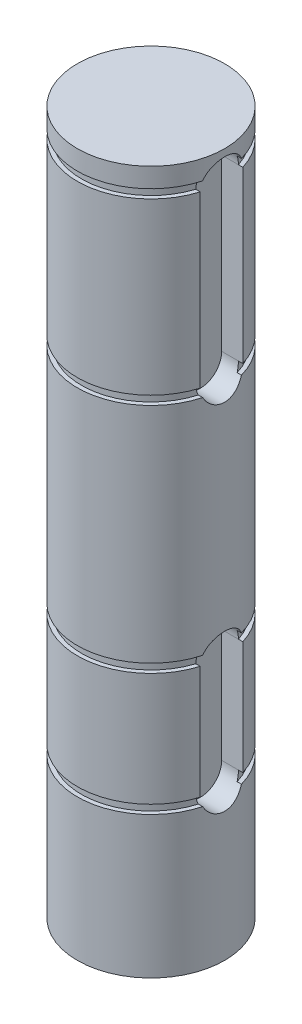
ISO-10303-21;
HEADER;
FILE_DESCRIPTION(('STEP AP214'),'2;1');
FILE_NAME('part.step','',(''),(''),'','','');
FILE_SCHEMA(('AUTOMOTIVE_DESIGN { 1 0 10303 214 1 1 1 1 }'));
ENDSEC;
DATA;
#1=APPLICATION_CONTEXT('core data for automotive mechanical design processes');
#2=APPLICATION_PROTOCOL_DEFINITION('international standard','automotive_design',2000,#1);
#3=PRODUCT_CONTEXT('',#1,'mechanical');
#4=PRODUCT('Part','Part','',(#3));
#5=PRODUCT_RELATED_PRODUCT_CATEGORY('part','',(#4));
#6=PRODUCT_DEFINITION_FORMATION('','',#4);
#7=PRODUCT_DEFINITION_CONTEXT('part definition',#1,'design');
#8=PRODUCT_DEFINITION('design','',#6,#7);
#9=PRODUCT_DEFINITION_SHAPE('','',#8);
#10=(LENGTH_UNIT() NAMED_UNIT(*) SI_UNIT(.MILLI.,.METRE.));
#11=(NAMED_UNIT(*) PLANE_ANGLE_UNIT() SI_UNIT($,.RADIAN.));
#12=(NAMED_UNIT(*) SI_UNIT($,.STERADIAN.) SOLID_ANGLE_UNIT());
#13=UNCERTAINTY_MEASURE_WITH_UNIT(LENGTH_MEASURE(1.E-05),#10,'distance_accuracy_value','');
#14=(GEOMETRIC_REPRESENTATION_CONTEXT(3) GLOBAL_UNCERTAINTY_ASSIGNED_CONTEXT((#13)) GLOBAL_UNIT_ASSIGNED_CONTEXT((#10,
#11,#12)) REPRESENTATION_CONTEXT('',''));
#15=CARTESIAN_POINT('',(0.,0.,0.));
#16=DIRECTION('',(0.,0.,1.));
#17=DIRECTION('',(1.,0.,0.));
#18=AXIS2_PLACEMENT_3D('',#15,#16,#17);
#19=CARTESIAN_POINT('',(0.,78.7908,0.));
#20=DIRECTION('',(0.,-1.,0.));
#21=DIRECTION('',(0.,0.,-1.));
#22=AXIS2_PLACEMENT_3D('',#19,#20,#21);
#23=CYLINDRICAL_SURFACE('',#22,8.255);
#24=DIRECTION('',(0.,-1.,0.));
#25=VECTOR('',#24,1.);
#26=CARTESIAN_POINT('',(7.90217636097803,78.7908,-2.3876));
#27=LINE('',#26,#25);
#28=CARTESIAN_POINT('',(7.90217636097803,56.5658,-2.3876));
#29=VERTEX_POINT('',#28);
#30=CARTESIAN_POINT('',(7.90217636097803,75.6158,-2.3876));
#31=VERTEX_POINT('',#30);
#32=EDGE_CURVE('E487',#29,#31,#27,.F.);
#33=ORIENTED_EDGE('',*,*,#32,.F.);
#34=CARTESIAN_POINT('',(0.,56.5658,0.));
#35=DIRECTION('',(0.,1.,0.));
#36=DIRECTION('',(0.,0.,1.));
#37=AXIS2_PLACEMENT_3D('',#34,#35,#36);
#38=CIRCLE('',#37,8.255);
#39=CARTESIAN_POINT('',(7.90217636097803,56.5658,2.3876));
#40=VERTEX_POINT('',#39);
#41=EDGE_CURVE('E339',#29,#40,#38,.T.);
#42=ORIENTED_EDGE('',*,*,#41,.T.);
#43=DIRECTION('',(0.,-1.,0.));
#44=VECTOR('',#43,1.);
#45=CARTESIAN_POINT('',(7.90217636097803,78.7908,2.3876));
#46=LINE('',#45,#44);
#47=CARTESIAN_POINT('',(7.90217636097803,75.6158,2.3876));
#48=VERTEX_POINT('',#47);
#49=EDGE_CURVE('E485',#40,#48,#46,.F.);
#50=ORIENTED_EDGE('',*,*,#49,.T.);
#51=CARTESIAN_POINT('',(0.,75.6158,0.));
#52=DIRECTION('',(0.,-1.,0.));
#53=DIRECTION('',(0.,0.,-1.));
#54=AXIS2_PLACEMENT_3D('',#51,#52,#53);
#55=CIRCLE('',#54,8.255);
#56=EDGE_CURVE('E348',#48,#31,#55,.T.);
#57=ORIENTED_EDGE('',*,*,#56,.T.);
#58=EDGE_LOOP('',(#33,#42,#50,#57));
#59=FACE_BOUND('',#58,.T.);
#60=ADVANCED_FACE('F33',(#59),#23,.T.);
#61=CARTESIAN_POINT('',(0.,75.6158,21.1239367260535));
#62=DIRECTION('',(0.,-1.,0.));
#63=DIRECTION('',(0.,0.,-1.));
#64=AXIS2_PLACEMENT_3D('',#61,#62,#63);
#65=PLANE('',#64);
#66=DIRECTION('',(1.,0.,0.));
#67=VECTOR('',#66,1.);
#68=CARTESIAN_POINT('',(5.5372,75.6158,-2.3876));
#69=LINE('',#68,#67);
#70=CARTESIAN_POINT('',(7.40993577907393,75.6158,-2.3876));
#71=VERTEX_POINT('',#70);
#72=EDGE_CURVE('E469',#71,#31,#69,.T.);
#73=ORIENTED_EDGE('',*,*,#72,.T.);
#74=ORIENTED_EDGE('',*,*,#56,.F.);
#75=DIRECTION('',(1.,0.,0.));
#76=VECTOR('',#75,1.);
#77=CARTESIAN_POINT('',(5.5372,75.6158,2.3876));
#78=LINE('',#77,#76);
#79=CARTESIAN_POINT('',(7.40993577907393,75.6158,2.3876));
#80=VERTEX_POINT('',#79);
#81=EDGE_CURVE('E465',#80,#48,#78,.T.);
#82=ORIENTED_EDGE('',*,*,#81,.F.);
#83=CARTESIAN_POINT('',(0.,75.6158,0.));
#84=DIRECTION('',(0.,1.,0.));
#85=DIRECTION('',(0.,0.,1.));
#86=AXIS2_PLACEMENT_3D('',#83,#84,#85);
#87=CIRCLE('',#86,7.7851);
#88=EDGE_CURVE('E349',#71,#80,#87,.T.);
#89=ORIENTED_EDGE('',*,*,#88,.F.);
#90=EDGE_LOOP('',(#73,#74,#82,#89));
#91=FACE_BOUND('',#90,.T.);
#92=ADVANCED_FACE('F287',(#91),#65,.F.);
#93=CARTESIAN_POINT('',(0.,55.5752,0.));
#94=DIRECTION('',(0.,-1.,0.));
#95=DIRECTION('',(0.,0.,-1.));
#96=AXIS2_PLACEMENT_3D('',#93,#94,#95);
#97=CIRCLE('',#96,8.255);
#98=CARTESIAN_POINT('',(7.96402408333877,55.5752,2.17240544098012));
#99=VERTEX_POINT('',#98);
#100=CARTESIAN_POINT('',(7.96402408333877,55.5752,-2.17240544098012));
#101=VERTEX_POINT('',#100);
#102=EDGE_CURVE('E342',#99,#101,#97,.T.);
#103=ORIENTED_EDGE('',*,*,#102,.T.);
#104=CARTESIAN_POINT('',(7.96402408333877,55.5752,-2.17240544098012));
#105=CARTESIAN_POINT('',(7.97169577027827,55.5135028583923,-2.14427075589016));
#106=CARTESIAN_POINT('',(7.97991829908887,55.4530949946041,-2.11355004383941));
#107=CARTESIAN_POINT('',(7.99720969642223,55.3352051903105,-2.0471567488907));
#108=CARTESIAN_POINT('',(8.00627841649396,55.2777227393116,-2.01148503403551));
#109=CARTESIAN_POINT('',(8.03435165880443,55.1102939537849,-1.89745365359604));
#110=CARTESIAN_POINT('',(8.05424396663146,55.0052083401573,-1.81200544231608));
#111=CARTESIAN_POINT('',(8.09410976756713,54.8110088215255,-1.62467488545157));
#112=CARTESIAN_POINT('',(8.11408326047165,54.7218948763856,-1.52279258116598));
#113=CARTESIAN_POINT('',(8.15191204625405,54.5619735436004,-1.30519198993988));
#114=CARTESIAN_POINT('',(8.16976772503073,54.491162818041,-1.18947623141052));
#115=CARTESIAN_POINT('',(8.20137618388929,54.3699819461733,-0.947284663026625));
#116=CARTESIAN_POINT('',(8.215129708747,54.319608088804,-0.820810811747385));
#117=CARTESIAN_POINT('',(8.23696946481187,54.2409961498277,-0.560685765782547));
#118=CARTESIAN_POINT('',(8.24505663417444,54.2127544038054,-0.427035763170005));
#119=CARTESIAN_POINT('',(8.25445652866956,54.1800303366697,-0.161340788264656));
#120=CARTESIAN_POINT('',(8.25599432683837,54.1747584901117,-0.0294007242491811));
#121=CARTESIAN_POINT('',(8.25274463000109,54.1860033251679,0.233454776654716));
#122=CARTESIAN_POINT('',(8.24795795965833,54.2025171660911,0.364370344890828));
#123=CARTESIAN_POINT('',(8.23272800264975,54.2562415744426,0.619039509085313));
#124=CARTESIAN_POINT('',(8.22238823644558,54.2930737006308,0.742879667038545));
#125=CARTESIAN_POINT('',(8.19719545606846,54.3859805474894,0.982626452653792));
#126=CARTESIAN_POINT('',(8.18234173390735,54.4420582869026,1.09853183229459));
#127=CARTESIAN_POINT('',(8.14922087599029,54.5734301786252,1.32224716698361));
#128=CARTESIAN_POINT('',(8.13087884582117,54.6491625869387,1.42978827893818));
#129=CARTESIAN_POINT('',(8.09294262671588,54.8170836561444,1.63088433939873));
#130=CARTESIAN_POINT('',(8.07334853961365,54.9092709797948,1.72444042329187));
#131=CARTESIAN_POINT('',(8.0376978400469,55.0936786428651,1.88311126462589));
#132=CARTESIAN_POINT('',(8.02153390801541,55.1840366361781,1.95037813914544));
#133=CARTESIAN_POINT('',(7.99107010580958,55.3734766789996,2.07163786545587));
#134=CARTESIAN_POINT('',(7.97676935405323,55.4725545651493,2.12563700579866));
#135=CARTESIAN_POINT('',(7.96402408333877,55.5752,2.17240544098012));
#136=B_SPLINE_CURVE_WITH_KNOTS('',3,(#104,#105,#106,#107,#108,#109,#110,#111,#112,#113,#114,
#115,#116,#117,#118,#119,#120,#121,#122,#123,#124,#125,#126,#127,#128,#129,#130,#131,#132,#133,
#134,#135),.UNSPECIFIED.,.F.,.F.,(4,2,2,2,2,2,2,2,2,2,2,2,2,2,2,4),(0.,0.204590558318854,
0.409145291665196,0.817736949036483,1.22632757963125,1.63484364387965,2.0432854938585,
2.4516597037935,2.84588058093287,3.24005005969466,3.62711431171269,4.01423930390274,
4.41087506402956,4.80747860541408,5.14778271292316,5.48792521286564),.UNSPECIFIED.);
#137=EDGE_CURVE('E408',#101,#99,#136,.T.);
#138=ORIENTED_EDGE('',*,*,#137,.T.);
#139=EDGE_LOOP('',(#103,#138));
#140=FACE_BOUND('',#139,.T.);
#141=CARTESIAN_POINT('',(0.,30.5562,0.));
#142=DIRECTION('',(0.,1.,0.));
#143=DIRECTION('',(0.,0.,1.));
#144=AXIS2_PLACEMENT_3D('',#141,#142,#143);
#145=CIRCLE('',#144,8.255);
#146=CARTESIAN_POINT('',(7.96402408333878,30.5562,-2.17240544098011));
#147=VERTEX_POINT('',#146);
#148=CARTESIAN_POINT('',(7.96402408333878,30.5562,2.1724054409801));
#149=VERTEX_POINT('',#148);
#150=EDGE_CURVE('E331',#147,#149,#145,.T.);
#151=ORIENTED_EDGE('',*,*,#150,.T.);
#152=CARTESIAN_POINT('',(7.96402408333878,30.5562,2.1724054409801));
#153=CARTESIAN_POINT('',(7.97169577027827,30.6178971416077,2.14427075589015));
#154=CARTESIAN_POINT('',(7.97991829908888,30.6783050053959,2.11355004383939));
#155=CARTESIAN_POINT('',(7.99720969642224,30.7961948096895,2.04715674889068));
#156=CARTESIAN_POINT('',(8.00627841649396,30.8536772606885,2.01148503403549));
#157=CARTESIAN_POINT('',(8.03435165880444,31.0211060462152,1.89745365359602));
#158=CARTESIAN_POINT('',(8.05424396663146,31.1261916598427,1.81200544231605));
#159=CARTESIAN_POINT('',(8.09410976756714,31.3203911784745,1.62467488545154));
#160=CARTESIAN_POINT('',(8.11408326047166,31.4095051236145,1.52279258116594));
#161=CARTESIAN_POINT('',(8.15191204625405,31.5694264563996,1.30519198993985));
#162=CARTESIAN_POINT('',(8.16976772503074,31.640237181959,1.18947623141048));
#163=CARTESIAN_POINT('',(8.2013761838893,31.7614180538268,0.947284663026578));
#164=CARTESIAN_POINT('',(8.21512970874701,31.811791911196,0.820810811747337));
#165=CARTESIAN_POINT('',(8.23696946481188,31.8904038501723,0.560685765782498));
#166=CARTESIAN_POINT('',(8.24505663417445,31.9186455961946,0.427035763169954));
#167=CARTESIAN_POINT('',(8.25445652866956,31.9513696633304,0.161340788264606));
#168=CARTESIAN_POINT('',(8.25599432683836,31.9566415098883,0.0294007242491316));
#169=CARTESIAN_POINT('',(8.25274463000109,31.9453966748321,-0.233454776654763));
#170=CARTESIAN_POINT('',(8.24795795965833,31.9288828339089,-0.364370344890874));
#171=CARTESIAN_POINT('',(8.23272800264974,31.8751584255574,-0.619039509085359));
#172=CARTESIAN_POINT('',(8.22238823644557,31.8383262993692,-0.74287966703859));
#173=CARTESIAN_POINT('',(8.19719545606845,31.7454194525105,-0.982626452653835));
#174=CARTESIAN_POINT('',(8.18234173390735,31.6893417130973,-1.09853183229463));
#175=CARTESIAN_POINT('',(8.14922087599029,31.5579698213747,-1.32224716698365));
#176=CARTESIAN_POINT('',(8.13087884582117,31.4822374130613,-1.42978827893822));
#177=CARTESIAN_POINT('',(8.09294262671587,31.3143163438555,-1.63088433939877));
#178=CARTESIAN_POINT('',(8.07334853961364,31.2221290202051,-1.7244404232919));
#179=CARTESIAN_POINT('',(8.0376978400469,31.0377213571349,-1.88311126462591));
#180=CARTESIAN_POINT('',(8.02153390801541,30.9473633638219,-1.95037813914545));
#181=CARTESIAN_POINT('',(7.99107010580959,30.7579233210004,-2.07163786545587));
#182=CARTESIAN_POINT('',(7.97676935405324,30.6588454348507,-2.12563700579865));
#183=CARTESIAN_POINT('',(7.96402408333878,30.5562,-2.1724054409801));
#184=B_SPLINE_CURVE_WITH_KNOTS('',3,(#152,#153,#154,#155,#156,#157,#158,#159,#160,#161,#162,
#163,#164,#165,#166,#167,#168,#169,#170,#171,#172,#173,#174,#175,#176,#177,#178,#179,#180,#181,
#182,#183),.UNSPECIFIED.,.F.,.F.,(4,2,2,2,2,2,2,2,2,2,2,2,2,2,2,4),(0.,0.204590558318864,
0.409145291665203,0.817736949036493,1.22632757963126,1.63484364387966,2.04328549385852,
2.45165970379352,2.84588058093289,3.24005005969467,3.6271143117127,4.01423930390275,
4.41087506402957,4.8074786054141,5.14778271292313,5.48792521286557),.UNSPECIFIED.);
#185=EDGE_CURVE('E214',#149,#147,#184,.T.);
#186=ORIENTED_EDGE('',*,*,#185,.T.);
#187=EDGE_LOOP('',(#151,#186));
#188=FACE_BOUND('',#187,.T.);
#189=ADVANCED_FACE('F289',(#140,#188),#23,.T.);
#190=CARTESIAN_POINT('',(0.,29.5656,0.));
#191=DIRECTION('',(0.,-1.,0.));
#192=DIRECTION('',(0.,0.,-1.));
#193=AXIS2_PLACEMENT_3D('',#190,#191,#192);
#194=CIRCLE('',#193,8.255);
#195=CARTESIAN_POINT('',(7.90217636097803,29.5656,2.3876));
#196=VERTEX_POINT('',#195);
#197=CARTESIAN_POINT('',(7.90217636097803,29.5656,-2.3876));
#198=VERTEX_POINT('',#197);
#199=EDGE_CURVE('E334',#196,#198,#194,.T.);
#200=ORIENTED_EDGE('',*,*,#199,.T.);
#201=DIRECTION('',(0.,-1.,0.));
#202=VECTOR('',#201,1.);
#203=CARTESIAN_POINT('',(7.90217636097803,78.7908,-2.38759999999999));
#204=LINE('',#203,#202);
#205=CARTESIAN_POINT('',(7.90217636097803,16.8656,-2.3876));
#206=VERTEX_POINT('',#205);
#207=EDGE_CURVE('E693',#198,#206,#204,.T.);
#208=ORIENTED_EDGE('',*,*,#207,.T.);
#209=CARTESIAN_POINT('',(0.,16.8656,0.));
#210=DIRECTION('',(0.,1.,0.));
#211=DIRECTION('',(0.,0.,1.));
#212=AXIS2_PLACEMENT_3D('',#209,#210,#211);
#213=CIRCLE('',#212,8.255);
#214=CARTESIAN_POINT('',(7.90217636097803,16.8656,2.3876));
#215=VERTEX_POINT('',#214);
#216=EDGE_CURVE('E326',#206,#215,#213,.T.);
#217=ORIENTED_EDGE('',*,*,#216,.T.);
#218=DIRECTION('',(0.,-1.,0.));
#219=VECTOR('',#218,1.);
#220=CARTESIAN_POINT('',(7.90217636097803,78.7908,2.38760000000001));
#221=LINE('',#220,#219);
#222=EDGE_CURVE('E698',#215,#196,#221,.F.);
#223=ORIENTED_EDGE('',*,*,#222,.T.);
#224=EDGE_LOOP('',(#200,#208,#217,#223));
#225=FACE_BOUND('',#224,.T.);
#226=ADVANCED_FACE('F283',(#225),#23,.T.);
#227=CARTESIAN_POINT('',(0.,15.875,0.));
#228=DIRECTION('',(0.,-1.,0.));
#229=DIRECTION('',(0.,0.,-1.));
#230=AXIS2_PLACEMENT_3D('',#227,#228,#229);
#231=CIRCLE('',#230,8.255);
#232=CARTESIAN_POINT('',(7.96402408333877,15.875,2.17240544098013));
#233=VERTEX_POINT('',#232);
#234=CARTESIAN_POINT('',(7.96402408333877,15.875,-2.17240544098011));
#235=VERTEX_POINT('',#234);
#236=EDGE_CURVE('E320',#233,#235,#231,.T.);
#237=ORIENTED_EDGE('',*,*,#236,.T.);
#238=CARTESIAN_POINT('',(7.96402408333877,15.875,-2.17240544098013));
#239=CARTESIAN_POINT('',(7.97169577027826,15.8133028583923,-2.14427075589017));
#240=CARTESIAN_POINT('',(7.97991829908887,15.7528949946041,-2.11355004383941));
#241=CARTESIAN_POINT('',(7.99720969642223,15.6350051903105,-2.0471567488907));
#242=CARTESIAN_POINT('',(8.00627841649396,15.5775227393116,-2.01148503403552));
#243=CARTESIAN_POINT('',(8.03435165880443,15.4100939537849,-1.89745365359605));
#244=CARTESIAN_POINT('',(8.05424396663146,15.3050083401573,-1.81200544231608));
#245=CARTESIAN_POINT('',(8.09410976756713,15.1108088215255,-1.62467488545158));
#246=CARTESIAN_POINT('',(8.11408326047165,15.0216948763856,-1.52279258116599));
#247=CARTESIAN_POINT('',(8.15191204625405,14.8617735436004,-1.30519198993989));
#248=CARTESIAN_POINT('',(8.16976772503073,14.7909628180411,-1.18947623141053));
#249=CARTESIAN_POINT('',(8.20137618388929,14.6697819461733,-0.947284663026633));
#250=CARTESIAN_POINT('',(8.215129708747,14.619408088804,-0.820810811747394));
#251=CARTESIAN_POINT('',(8.23696946481187,14.5407961498277,-0.560685765782558));
#252=CARTESIAN_POINT('',(8.24505663417444,14.5125544038054,-0.427035763170016));
#253=CARTESIAN_POINT('',(8.25445652866956,14.4798303366697,-0.161340788264669));
#254=CARTESIAN_POINT('',(8.25599432683837,14.4745584901117,-0.0294007242491934));
#255=CARTESIAN_POINT('',(8.25274463000109,14.4858033251679,0.233454776654704));
#256=CARTESIAN_POINT('',(8.24795795965833,14.5023171660911,0.364370344890817));
#257=CARTESIAN_POINT('',(8.23272800264975,14.5560415744426,0.619039509085303));
#258=CARTESIAN_POINT('',(8.22238823644558,14.5928737006308,0.742879667038535));
#259=CARTESIAN_POINT('',(8.19719545606846,14.6857805474894,0.982626452653782));
#260=CARTESIAN_POINT('',(8.18234173390735,14.7418582869026,1.09853183229458));
#261=CARTESIAN_POINT('',(8.1492208759903,14.8732301786252,1.3222471669836));
#262=CARTESIAN_POINT('',(8.13087884582118,14.9489625869387,1.42978827893817));
#263=CARTESIAN_POINT('',(8.09294262671588,15.1168836561444,1.63088433939872));
#264=CARTESIAN_POINT('',(8.07334853961365,15.2090709797948,1.72444042329186));
#265=CARTESIAN_POINT('',(8.0376978400469,15.3934786428651,1.88311126462589));
#266=CARTESIAN_POINT('',(8.02153390801541,15.4838366361781,1.95037813914544));
#267=CARTESIAN_POINT('',(7.99107010580958,15.6732766789996,2.07163786545588));
#268=CARTESIAN_POINT('',(7.97676935405323,15.7723545651493,2.12563700579867));
#269=CARTESIAN_POINT('',(7.96402408333877,15.875,2.17240544098013));
#270=B_SPLINE_CURVE_WITH_KNOTS('',3,(#238,#239,#240,#241,#242,#243,#244,#245,#246,#247,#248,
#249,#250,#251,#252,#253,#254,#255,#256,#257,#258,#259,#260,#261,#262,#263,#264,#265,#266,#267,
#268,#269),.UNSPECIFIED.,.F.,.F.,(4,2,2,2,2,2,2,2,2,2,2,2,2,2,2,4),(0.,0.204590558318864,
0.409145291665199,0.817736949036489,1.22632757963126,1.63484364387966,2.04328549385851,
2.45165970379351,2.84588058093288,3.24005005969467,3.62711431171269,4.01423930390274,
4.41087506402956,4.80747860541409,5.14778271292318,5.48792521286568),.UNSPECIFIED.);
#271=EDGE_CURVE('E447',#235,#233,#270,.T.);
#272=ORIENTED_EDGE('',*,*,#271,.T.);
#273=EDGE_LOOP('',(#237,#272));
#274=FACE_BOUND('',#273,.T.);
#275=CARTESIAN_POINT('',(0.,0.,0.));
#276=DIRECTION('',(0.,1.,0.));
#277=DIRECTION('',(0.,0.,1.));
#278=AXIS2_PLACEMENT_3D('',#275,#276,#277);
#279=CIRCLE('',#278,8.255);
#280=CARTESIAN_POINT('',(0.,0.,8.255));
#281=VERTEX_POINT('',#280);
#282=EDGE_CURVE('E315',#281,#281,#279,.T.);
#283=ORIENTED_EDGE('',*,*,#282,.T.);
#284=EDGE_LOOP('',(#283));
#285=FACE_BOUND('',#284,.T.);
#286=ADVANCED_FACE('F278',(#274,#285),#23,.T.);
#287=CARTESIAN_POINT('',(0.,0.,0.));
#288=DIRECTION('',(0.,1.,0.));
#289=DIRECTION('',(0.,0.,1.));
#290=AXIS2_PLACEMENT_3D('',#287,#288,#289);
#291=PLANE('',#290);
#292=ORIENTED_EDGE('',*,*,#282,.F.);
#293=EDGE_LOOP('',(#292));
#294=FACE_BOUND('',#293,.T.);
#295=ADVANCED_FACE('F271',(#294),#291,.F.);
#296=CARTESIAN_POINT('',(0.,15.875,35.9296438771156));
#297=DIRECTION('',(0.,-1.,0.));
#298=DIRECTION('',(0.,0.,-1.));
#299=AXIS2_PLACEMENT_3D('',#296,#297,#298);
#300=PLANE('',#299);
#301=CARTESIAN_POINT('',(0.,15.875,0.));
#302=DIRECTION('',(0.,1.,0.));
#303=DIRECTION('',(0.,0.,1.));
#304=AXIS2_PLACEMENT_3D('',#301,#302,#303);
#305=CIRCLE('',#304,7.7851);
#306=CARTESIAN_POINT('',(7.47585691476235,15.875,-2.17240544098011));
#307=VERTEX_POINT('',#306);
#308=CARTESIAN_POINT('',(7.47585691476235,15.875,2.17240544098011));
#309=VERTEX_POINT('',#308);
#310=EDGE_CURVE('E323',#307,#309,#305,.T.);
#311=ORIENTED_EDGE('',*,*,#310,.F.);
#312=DIRECTION('',(1.,0.,0.));
#313=VECTOR('',#312,1.);
#314=CARTESIAN_POINT('',(5.5372,15.875,-2.17240544098011));
#315=LINE('',#314,#313);
#316=EDGE_CURVE('E442',#307,#235,#315,.T.);
#317=ORIENTED_EDGE('',*,*,#316,.T.);
#318=ORIENTED_EDGE('',*,*,#236,.F.);
#319=DIRECTION('',(1.,0.,0.));
#320=VECTOR('',#319,1.);
#321=CARTESIAN_POINT('',(5.5372,15.875,2.17240544098011));
#322=LINE('',#321,#320);
#323=EDGE_CURVE('E443',#233,#309,#322,.F.);
#324=ORIENTED_EDGE('',*,*,#323,.T.);
#325=EDGE_LOOP('',(#311,#317,#318,#324));
#326=FACE_BOUND('',#325,.T.);
#327=ADVANCED_FACE('F262',(#326),#300,.F.);
#328=CARTESIAN_POINT('',(0.,16.8656,35.9296438771156));
#329=DIRECTION('',(0.,1.,0.));
#330=DIRECTION('',(0.,0.,1.));
#331=AXIS2_PLACEMENT_3D('',#328,#329,#330);
#332=PLANE('',#331);
#333=ORIENTED_EDGE('',*,*,#216,.F.);
#334=DIRECTION('',(1.,0.,0.));
#335=VECTOR('',#334,1.);
#336=CARTESIAN_POINT('',(5.5372,16.8656,-2.3876));
#337=LINE('',#336,#335);
#338=CARTESIAN_POINT('',(7.40993577907393,16.8656,-2.3876));
#339=VERTEX_POINT('',#338);
#340=EDGE_CURVE('E210',#339,#206,#337,.T.);
#341=ORIENTED_EDGE('',*,*,#340,.F.);
#342=CARTESIAN_POINT('',(0.,16.8656,0.));
#343=DIRECTION('',(0.,1.,0.));
#344=DIRECTION('',(0.,0.,1.));
#345=AXIS2_PLACEMENT_3D('',#342,#343,#344);
#346=CIRCLE('',#345,7.7851);
#347=CARTESIAN_POINT('',(7.40993577907393,16.8656,2.3876));
#348=VERTEX_POINT('',#347);
#349=EDGE_CURVE('E338',#339,#348,#346,.T.);
#350=ORIENTED_EDGE('',*,*,#349,.T.);
#351=DIRECTION('',(1.,0.,0.));
#352=VECTOR('',#351,1.);
#353=CARTESIAN_POINT('',(5.5372,16.8656,2.3876));
#354=LINE('',#353,#352);
#355=EDGE_CURVE('E184',#348,#215,#354,.T.);
#356=ORIENTED_EDGE('',*,*,#355,.T.);
#357=EDGE_LOOP('',(#333,#341,#350,#356));
#358=FACE_BOUND('',#357,.T.);
#359=ADVANCED_FACE('F260',(#358),#332,.F.);
#360=CARTESIAN_POINT('',(0.,29.9273187776748,0.));
#361=DIRECTION('',(0.,1.,0.));
#362=DIRECTION('',(0.,0.,1.));
#363=AXIS2_PLACEMENT_3D('',#360,#361,#362);
#364=CYLINDRICAL_SURFACE('',#363,7.7851);
#365=ORIENTED_EDGE('',*,*,#310,.T.);
#366=CARTESIAN_POINT('',(7.47585691476235,15.875,2.17240544098011));
#367=CARTESIAN_POINT('',(7.46800770533335,15.9341869066255,2.19940220788417));
#368=CARTESIAN_POINT('',(7.46070607178622,15.9945486977164,2.22399697790815));
#369=CARTESIAN_POINT('',(7.44738110721465,16.1172470052637,2.26822571826626));
#370=CARTESIAN_POINT('',(7.44135866431199,16.1795848593837,2.28785624379459));
#371=CARTESIAN_POINT('',(7.43088439285811,16.304610073417,2.32164641591105));
#372=CARTESIAN_POINT('',(7.42640557289467,16.3672696397758,2.33590054193313));
#373=CARTESIAN_POINT('',(7.41900078301951,16.493587396284,2.35931384822128));
#374=CARTESIAN_POINT('',(7.41607376574984,16.5572448829555,2.36847646510037));
#375=CARTESIAN_POINT('',(7.41263170277545,16.6616451752925,2.379220810497));
#376=CARTESIAN_POINT('',(7.41162565083335,16.702219203553,2.38235078269739));
#377=CARTESIAN_POINT('',(7.41027512040859,16.7837267119815,2.38654694530532));
#378=CARTESIAN_POINT('',(7.40993461014244,16.8246608951542,2.38760075713839));
#379=CARTESIAN_POINT('',(7.40993577907393,16.8656,2.3876));
#380=B_SPLINE_CURVE_WITH_KNOTS('',3,(#366,#367,#368,#369,#370,#371,#372,#373,#374,#375,#376,
#377,#378,#379),.UNSPECIFIED.,.F.,.F.,(4,2,2,2,2,2,4),(0.,0.196528648046228,0.393193300010768,
0.586220206334327,0.779116666648224,0.901183670504069,1.02397629117905),.UNSPECIFIED.);
#381=EDGE_CURVE('E11',#309,#348,#380,.T.);
#382=ORIENTED_EDGE('',*,*,#381,.T.);
#383=ORIENTED_EDGE('',*,*,#349,.F.);
#384=CARTESIAN_POINT('',(7.40993577907393,16.8656,-2.3876));
#385=CARTESIAN_POINT('',(7.40992597765185,16.8000647620385,-2.38760926005927));
#386=CARTESIAN_POINT('',(7.41080483954391,16.7345319044724,-2.38490224595912));
#387=CARTESIAN_POINT('',(7.41426962218844,16.6039344144865,-2.37412026806146));
#388=CARTESIAN_POINT('',(7.41685605173157,16.5388699274664,-2.36604370433595));
#389=CARTESIAN_POINT('',(7.4236038883145,16.4108832260323,-2.34478182126083));
#390=CARTESIAN_POINT('',(7.42773588772303,16.3479435591192,-2.33169178854914));
#391=CARTESIAN_POINT('',(7.43744908070246,16.2234585505452,-2.30052192594414));
#392=CARTESIAN_POINT('',(7.44302947944861,16.1619124642188,-2.28244483241308));
#393=CARTESIAN_POINT('',(7.45319003521996,16.0628840931565,-2.24898266648515));
#394=CARTESIAN_POINT('',(7.45738491769942,16.0248650553309,-2.23504695294817));
#395=CARTESIAN_POINT('',(7.46626664494621,15.9494106358695,-2.20519539084975));
#396=CARTESIAN_POINT('',(7.47095622312326,15.9119799673831,-2.18926843955845));
#397=CARTESIAN_POINT('',(7.47585691476235,15.875,-2.17240544098011));
#398=B_SPLINE_CURVE_WITH_KNOTS('',3,(#384,#385,#386,#387,#388,#389,#390,#391,#392,#393,#394,
#395,#396,#397),.UNSPECIFIED.,.F.,.F.,(4,2,2,2,2,2,4),(0.,0.196540823614057,0.393140235416378,
0.586174930205822,0.779103918268664,0.901181563625823,1.02397308473336),.UNSPECIFIED.);
#399=EDGE_CURVE('E47',#339,#307,#398,.T.);
#400=ORIENTED_EDGE('',*,*,#399,.T.);
#401=EDGE_LOOP('',(#365,#382,#383,#400));
#402=FACE_BOUND('',#401,.T.);
#403=ADVANCED_FACE('F258',(#402),#364,.T.);
#404=CARTESIAN_POINT('',(0.,29.5656,20.6586251477621));
#405=DIRECTION('',(0.,-1.,0.));
#406=DIRECTION('',(0.,0.,-1.));
#407=AXIS2_PLACEMENT_3D('',#404,#405,#406);
#408=PLANE('',#407);
#409=CARTESIAN_POINT('',(0.,29.5656,0.));
#410=DIRECTION('',(0.,1.,0.));
#411=DIRECTION('',(0.,0.,1.));
#412=AXIS2_PLACEMENT_3D('',#409,#410,#411);
#413=CIRCLE('',#412,7.7851);
#414=CARTESIAN_POINT('',(7.40993577907393,29.5656,-2.3876));
#415=VERTEX_POINT('',#414);
#416=CARTESIAN_POINT('',(7.40993577907393,29.5656,2.3876));
#417=VERTEX_POINT('',#416);
#418=EDGE_CURVE('E335',#415,#417,#413,.T.);
#419=ORIENTED_EDGE('',*,*,#418,.F.);
#420=DIRECTION('',(1.,0.,0.));
#421=VECTOR('',#420,1.);
#422=CARTESIAN_POINT('',(5.5372,29.5656,-2.3876));
#423=LINE('',#422,#421);
#424=EDGE_CURVE('E206',#415,#198,#423,.T.);
#425=ORIENTED_EDGE('',*,*,#424,.T.);
#426=ORIENTED_EDGE('',*,*,#199,.F.);
#427=DIRECTION('',(1.,0.,0.));
#428=VECTOR('',#427,1.);
#429=CARTESIAN_POINT('',(5.5372,29.5656,2.3876));
#430=LINE('',#429,#428);
#431=EDGE_CURVE('E185',#417,#196,#430,.T.);
#432=ORIENTED_EDGE('',*,*,#431,.F.);
#433=EDGE_LOOP('',(#419,#425,#426,#432));
#434=FACE_BOUND('',#433,.T.);
#435=ADVANCED_FACE('F254',(#434),#408,.F.);
#436=CARTESIAN_POINT('',(0.,30.5562,20.6586251477621));
#437=DIRECTION('',(0.,1.,0.));
#438=DIRECTION('',(0.,0.,1.));
#439=AXIS2_PLACEMENT_3D('',#436,#437,#438);
#440=PLANE('',#439);
#441=CARTESIAN_POINT('',(0.,30.5562,0.));
#442=DIRECTION('',(0.,1.,0.));
#443=DIRECTION('',(0.,0.,1.));
#444=AXIS2_PLACEMENT_3D('',#441,#442,#443);
#445=CIRCLE('',#444,7.7851);
#446=CARTESIAN_POINT('',(7.47585691476235,30.5562,-2.17240544098011));
#447=VERTEX_POINT('',#446);
#448=CARTESIAN_POINT('',(7.47585691476235,30.5562,2.17240544098011));
#449=VERTEX_POINT('',#448);
#450=EDGE_CURVE('E346',#447,#449,#445,.T.);
#451=ORIENTED_EDGE('',*,*,#450,.T.);
#452=DIRECTION('',(1.,0.,0.));
#453=VECTOR('',#452,1.);
#454=CARTESIAN_POINT('',(5.5372,30.5562,2.17240544098011));
#455=LINE('',#454,#453);
#456=EDGE_CURVE('E221',#449,#149,#455,.T.);
#457=ORIENTED_EDGE('',*,*,#456,.T.);
#458=ORIENTED_EDGE('',*,*,#150,.F.);
#459=DIRECTION('',(1.,0.,0.));
#460=VECTOR('',#459,1.);
#461=CARTESIAN_POINT('',(5.5372,30.5562,-2.17240544098011));
#462=LINE('',#461,#460);
#463=EDGE_CURVE('E205',#147,#447,#462,.F.);
#464=ORIENTED_EDGE('',*,*,#463,.T.);
#465=EDGE_LOOP('',(#451,#457,#458,#464));
#466=FACE_BOUND('',#465,.T.);
#467=ADVANCED_FACE('F251',(#466),#440,.F.);
#468=CARTESIAN_POINT('',(0.,33.7906577715191,0.));
#469=DIRECTION('',(0.,1.,0.));
#470=DIRECTION('',(0.,0.,1.));
#471=AXIS2_PLACEMENT_3D('',#468,#469,#470);
#472=CYLINDRICAL_SURFACE('',#471,7.7851);
#473=ORIENTED_EDGE('',*,*,#418,.T.);
#474=CARTESIAN_POINT('',(7.40993577907393,29.5656,2.3876));
#475=CARTESIAN_POINT('',(7.40992597765185,29.6311352379615,2.38760926005927));
#476=CARTESIAN_POINT('',(7.4108048395439,29.6966680955276,2.38490224595912));
#477=CARTESIAN_POINT('',(7.41426962218843,29.8272655855135,2.37412026806146));
#478=CARTESIAN_POINT('',(7.41685605173157,29.8923300725336,2.36604370433595));
#479=CARTESIAN_POINT('',(7.4236038883145,30.0203167739677,2.34478182126083));
#480=CARTESIAN_POINT('',(7.42773588772302,30.0832564408808,2.33169178854914));
#481=CARTESIAN_POINT('',(7.43744908070245,30.2077414494548,2.30052192594414));
#482=CARTESIAN_POINT('',(7.4430294794486,30.2692875357812,2.28244483241308));
#483=CARTESIAN_POINT('',(7.45319003521996,30.3683159068435,2.24898266648514));
#484=CARTESIAN_POINT('',(7.45738491769942,30.4063349446691,2.23504695294817));
#485=CARTESIAN_POINT('',(7.46626664494621,30.4817893641305,2.20519539084975));
#486=CARTESIAN_POINT('',(7.47095622312326,30.5192200326169,2.18926843955845));
#487=CARTESIAN_POINT('',(7.47585691476235,30.5562,2.17240544098011));
#488=B_SPLINE_CURVE_WITH_KNOTS('',3,(#474,#475,#476,#477,#478,#479,#480,#481,#482,#483,#484,
#485,#486,#487),.UNSPECIFIED.,.F.,.F.,(4,2,2,2,2,2,4),(0.,0.19654082361406,0.393140235416381,
0.586174930205823,0.779103918268665,0.901181563625823,1.02397308473336),.UNSPECIFIED.);
#489=EDGE_CURVE('E181',#417,#449,#488,.T.);
#490=ORIENTED_EDGE('',*,*,#489,.T.);
#491=ORIENTED_EDGE('',*,*,#450,.F.);
#492=CARTESIAN_POINT('',(7.47585691476235,30.5562,-2.17240544098011));
#493=CARTESIAN_POINT('',(7.46800770533335,30.4970130933745,-2.19940220788417));
#494=CARTESIAN_POINT('',(7.46070607178622,30.4366513022836,-2.22399697790815));
#495=CARTESIAN_POINT('',(7.44738110721465,30.3139529947363,-2.26822571826626));
#496=CARTESIAN_POINT('',(7.44135866431199,30.2516151406163,-2.28785624379458));
#497=CARTESIAN_POINT('',(7.43088439285811,30.126589926583,-2.32164641591105));
#498=CARTESIAN_POINT('',(7.42640557289467,30.0639303602242,-2.33590054193313));
#499=CARTESIAN_POINT('',(7.41900078301951,29.937612603716,-2.35931384822128));
#500=CARTESIAN_POINT('',(7.41607376574984,29.8739551170445,-2.36847646510037));
#501=CARTESIAN_POINT('',(7.41263170277544,29.7695548247075,-2.379220810497));
#502=CARTESIAN_POINT('',(7.41162565083334,29.728980796447,-2.38235078269739));
#503=CARTESIAN_POINT('',(7.41027512040858,29.6474732880185,-2.38654694530532));
#504=CARTESIAN_POINT('',(7.40993461014244,29.6065391048458,-2.38760075713839));
#505=CARTESIAN_POINT('',(7.40993577907393,29.5656,-2.3876));
#506=B_SPLINE_CURVE_WITH_KNOTS('',3,(#492,#493,#494,#495,#496,#497,#498,#499,#500,#501,#502,
#503,#504,#505),.UNSPECIFIED.,.F.,.F.,(4,2,2,2,2,2,4),(0.,0.196528648046224,0.393193300010768,
0.586220206334327,0.779116666648228,0.901183670504073,1.02397629117905),.UNSPECIFIED.);
#507=EDGE_CURVE('E232',#447,#415,#506,.T.);
#508=ORIENTED_EDGE('',*,*,#507,.T.);
#509=EDGE_LOOP('',(#473,#490,#491,#508));
#510=FACE_BOUND('',#509,.T.);
#511=ADVANCED_FACE('F245',(#510),#472,.T.);
#512=CARTESIAN_POINT('',(0.,55.5752,26.2953981874016));
#513=DIRECTION('',(0.,-1.,0.));
#514=DIRECTION('',(0.,0.,-1.));
#515=AXIS2_PLACEMENT_3D('',#512,#513,#514);
#516=PLANE('',#515);
#517=CARTESIAN_POINT('',(0.,55.5752,0.));
#518=DIRECTION('',(0.,1.,0.));
#519=DIRECTION('',(0.,0.,1.));
#520=AXIS2_PLACEMENT_3D('',#517,#518,#519);
#521=CIRCLE('',#520,7.7851);
#522=CARTESIAN_POINT('',(7.47585691476235,55.5752,-2.17240544098012));
#523=VERTEX_POINT('',#522);
#524=CARTESIAN_POINT('',(7.47585691476235,55.5752,2.17240544098012));
#525=VERTEX_POINT('',#524);
#526=EDGE_CURVE('E343',#523,#525,#521,.T.);
#527=ORIENTED_EDGE('',*,*,#526,.F.);
#528=DIRECTION('',(1.,0.,0.));
#529=VECTOR('',#528,1.);
#530=CARTESIAN_POINT('',(5.5372,55.5752,-2.17240544098012));
#531=LINE('',#530,#529);
#532=EDGE_CURVE('E416',#523,#101,#531,.T.);
#533=ORIENTED_EDGE('',*,*,#532,.T.);
#534=ORIENTED_EDGE('',*,*,#102,.F.);
#535=DIRECTION('',(1.,0.,0.));
#536=VECTOR('',#535,1.);
#537=CARTESIAN_POINT('',(5.5372,55.5752,2.17240544098012));
#538=LINE('',#537,#536);
#539=EDGE_CURVE('E415',#99,#525,#538,.F.);
#540=ORIENTED_EDGE('',*,*,#539,.T.);
#541=EDGE_LOOP('',(#527,#533,#534,#540));
#542=FACE_BOUND('',#541,.T.);
#543=ADVANCED_FACE('F250',(#542),#516,.F.);
#544=CARTESIAN_POINT('',(0.,56.5658,26.2953981874016));
#545=DIRECTION('',(0.,1.,0.));
#546=DIRECTION('',(0.,0.,1.));
#547=AXIS2_PLACEMENT_3D('',#544,#545,#546);
#548=PLANE('',#547);
#549=ORIENTED_EDGE('',*,*,#41,.F.);
#550=DIRECTION('',(1.,0.,0.));
#551=VECTOR('',#550,1.);
#552=CARTESIAN_POINT('',(5.5372,56.5658,-2.3876));
#553=LINE('',#552,#551);
#554=CARTESIAN_POINT('',(7.40993577907393,56.5658,-2.3876));
#555=VERTEX_POINT('',#554);
#556=EDGE_CURVE('E473',#555,#29,#553,.T.);
#557=ORIENTED_EDGE('',*,*,#556,.F.);
#558=CARTESIAN_POINT('',(0.,56.5658,0.));
#559=DIRECTION('',(0.,1.,0.));
#560=DIRECTION('',(0.,0.,1.));
#561=AXIS2_PLACEMENT_3D('',#558,#559,#560);
#562=CIRCLE('',#561,7.7851);
#563=CARTESIAN_POINT('',(7.40993577907393,56.5658,2.3876));
#564=VERTEX_POINT('',#563);
#565=EDGE_CURVE('E351',#555,#564,#562,.T.);
#566=ORIENTED_EDGE('',*,*,#565,.T.);
#567=DIRECTION('',(1.,0.,0.));
#568=VECTOR('',#567,1.);
#569=CARTESIAN_POINT('',(5.5372,56.5658,2.3876));
#570=LINE('',#569,#568);
#571=EDGE_CURVE('E477',#564,#40,#570,.T.);
#572=ORIENTED_EDGE('',*,*,#571,.T.);
#573=EDGE_LOOP('',(#549,#557,#566,#572));
#574=FACE_BOUND('',#573,.T.);
#575=ADVANCED_FACE('F391',(#574),#548,.F.);
#576=CARTESIAN_POINT('',(0.,60.6077730605445,0.));
#577=DIRECTION('',(0.,1.,0.));
#578=DIRECTION('',(0.,0.,1.));
#579=AXIS2_PLACEMENT_3D('',#576,#577,#578);
#580=CYLINDRICAL_SURFACE('',#579,7.7851);
#581=ORIENTED_EDGE('',*,*,#526,.T.);
#582=CARTESIAN_POINT('',(7.47585691476235,55.5752,2.17240544098012));
#583=CARTESIAN_POINT('',(7.46800770533335,55.6343869066255,2.19940220788417));
#584=CARTESIAN_POINT('',(7.46070607178622,55.6947486977164,2.22399697790815));
#585=CARTESIAN_POINT('',(7.44738110721465,55.8174470052637,2.26822571826626));
#586=CARTESIAN_POINT('',(7.44135866431199,55.8797848593837,2.28785624379458));
#587=CARTESIAN_POINT('',(7.43088439285811,56.004810073417,2.32164641591105));
#588=CARTESIAN_POINT('',(7.42640557289467,56.0674696397757,2.33590054193313));
#589=CARTESIAN_POINT('',(7.41900078301951,56.193787396284,2.35931384822128));
#590=CARTESIAN_POINT('',(7.41607376574984,56.2574448829554,2.36847646510037));
#591=CARTESIAN_POINT('',(7.41263170277544,56.3618451752925,2.379220810497));
#592=CARTESIAN_POINT('',(7.41162565083334,56.402419203553,2.38235078269739));
#593=CARTESIAN_POINT('',(7.41027512040858,56.4839267119815,2.38654694530532));
#594=CARTESIAN_POINT('',(7.40993461014244,56.5248608951542,2.38760075713839));
#595=CARTESIAN_POINT('',(7.40993577907393,56.5658,2.3876));
#596=B_SPLINE_CURVE_WITH_KNOTS('',3,(#582,#583,#584,#585,#586,#587,#588,#589,#590,#591,#592,
#593,#594,#595),.UNSPECIFIED.,.F.,.F.,(4,2,2,2,2,2,4),(0.,0.196528648046223,0.39319330001076,
0.586220206334302,0.77911666664822,0.901183670504072,1.02397629117905),.UNSPECIFIED.);
#597=EDGE_CURVE('E399',#525,#564,#596,.T.);
#598=ORIENTED_EDGE('',*,*,#597,.T.);
#599=ORIENTED_EDGE('',*,*,#565,.F.);
#600=CARTESIAN_POINT('',(7.40993577907393,56.5658,-2.3876));
#601=CARTESIAN_POINT('',(7.40992597765185,56.5002647620385,-2.38760926005927));
#602=CARTESIAN_POINT('',(7.4108048395439,56.4347319044725,-2.38490224595912));
#603=CARTESIAN_POINT('',(7.41426962218843,56.3041344144865,-2.37412026806146));
#604=CARTESIAN_POINT('',(7.41685605173157,56.2390699274664,-2.36604370433595));
#605=CARTESIAN_POINT('',(7.4236038883145,56.1110832260323,-2.34478182126083));
#606=CARTESIAN_POINT('',(7.42773588772302,56.0481435591193,-2.33169178854914));
#607=CARTESIAN_POINT('',(7.43744908070245,55.9236585505452,-2.30052192594415));
#608=CARTESIAN_POINT('',(7.4430294794486,55.8621124642188,-2.28244483241308));
#609=CARTESIAN_POINT('',(7.45319003521996,55.7630840931565,-2.24898266648515));
#610=CARTESIAN_POINT('',(7.45738491769942,55.7250650553309,-2.23504695294818));
#611=CARTESIAN_POINT('',(7.46626664494621,55.6496106358695,-2.20519539084975));
#612=CARTESIAN_POINT('',(7.47095622312325,55.6121799673831,-2.18926843955845));
#613=CARTESIAN_POINT('',(7.47585691476235,55.5752,-2.17240544098012));
#614=B_SPLINE_CURVE_WITH_KNOTS('',3,(#600,#601,#602,#603,#604,#605,#606,#607,#608,#609,#610,
#611,#612,#613),.UNSPECIFIED.,.F.,.F.,(4,2,2,2,2,2,4),(0.,0.19654082361406,0.393140235416378,
0.586174930205815,0.779103918268664,0.901181563625822,1.02397308473335),.UNSPECIFIED.);
#615=EDGE_CURVE('E317',#555,#523,#614,.T.);
#616=ORIENTED_EDGE('',*,*,#615,.T.);
#617=EDGE_LOOP('',(#581,#598,#599,#616));
#618=FACE_BOUND('',#617,.T.);
#619=ADVANCED_FACE('F393',(#618),#580,.T.);
#620=CARTESIAN_POINT('',(0.,76.6064,21.1239367260535));
#621=DIRECTION('',(0.,1.,0.));
#622=DIRECTION('',(0.,0.,1.));
#623=AXIS2_PLACEMENT_3D('',#620,#621,#622);
#624=PLANE('',#623);
#625=CARTESIAN_POINT('',(0.,76.6064,0.));
#626=DIRECTION('',(0.,1.,0.));
#627=DIRECTION('',(0.,0.,1.));
#628=AXIS2_PLACEMENT_3D('',#625,#626,#627);
#629=CIRCLE('',#628,7.7851);
#630=CARTESIAN_POINT('',(7.47585691476235,76.6064,-2.17240544098012));
#631=VERTEX_POINT('',#630);
#632=CARTESIAN_POINT('',(7.47585691476235,76.6064,2.17240544098012));
#633=VERTEX_POINT('',#632);
#634=EDGE_CURVE('E420',#631,#633,#629,.T.);
#635=ORIENTED_EDGE('',*,*,#634,.T.);
#636=DIRECTION('',(1.,0.,0.));
#637=VECTOR('',#636,1.);
#638=CARTESIAN_POINT('',(5.5372,76.6064,2.17240544098012));
#639=LINE('',#638,#637);
#640=CARTESIAN_POINT('',(7.96402408333877,76.6064,2.17240544098012));
#641=VERTEX_POINT('',#640);
#642=EDGE_CURVE('E380',#633,#641,#639,.T.);
#643=ORIENTED_EDGE('',*,*,#642,.T.);
#644=CARTESIAN_POINT('',(0.,76.6064,0.));
#645=DIRECTION('',(0.,1.,0.));
#646=DIRECTION('',(0.,0.,1.));
#647=AXIS2_PLACEMENT_3D('',#644,#645,#646);
#648=CIRCLE('',#647,8.255);
#649=CARTESIAN_POINT('',(7.96402408333877,76.6064,-2.17240544098012));
#650=VERTEX_POINT('',#649);
#651=EDGE_CURVE('E310',#650,#641,#648,.T.);
#652=ORIENTED_EDGE('',*,*,#651,.F.);
#653=DIRECTION('',(1.,0.,0.));
#654=VECTOR('',#653,1.);
#655=CARTESIAN_POINT('',(5.5372,76.6064,-2.17240544098012));
#656=LINE('',#655,#654);
#657=EDGE_CURVE('E62',#650,#631,#656,.F.);
#658=ORIENTED_EDGE('',*,*,#657,.T.);
#659=EDGE_LOOP('',(#635,#643,#652,#658));
#660=FACE_BOUND('',#659,.T.);
#661=ADVANCED_FACE('F367',(#660),#624,.F.);
#662=CARTESIAN_POINT('',(0.,77.1553752870088,0.));
#663=DIRECTION('',(0.,1.,0.));
#664=DIRECTION('',(0.,0.,1.));
#665=AXIS2_PLACEMENT_3D('',#662,#663,#664);
#666=CYLINDRICAL_SURFACE('',#665,7.7851);
#667=ORIENTED_EDGE('',*,*,#88,.T.);
#668=CARTESIAN_POINT('',(7.40993577907393,75.6158,2.3876));
#669=CARTESIAN_POINT('',(7.40992597765185,75.6813352379616,2.38760926005927));
#670=CARTESIAN_POINT('',(7.4108048395439,75.7468680955276,2.38490224595912));
#671=CARTESIAN_POINT('',(7.41426962218843,75.8774655855135,2.37412026806146));
#672=CARTESIAN_POINT('',(7.41685605173157,75.9425300725336,2.36604370433594));
#673=CARTESIAN_POINT('',(7.4236038883145,76.0705167739678,2.34478182126083));
#674=CARTESIAN_POINT('',(7.42773588772302,76.1334564408808,2.33169178854914));
#675=CARTESIAN_POINT('',(7.43744908070245,76.2579414494548,2.30052192594414));
#676=CARTESIAN_POINT('',(7.4430294794486,76.3194875357812,2.28244483241308));
#677=CARTESIAN_POINT('',(7.45319003521996,76.4185159068435,2.24898266648515));
#678=CARTESIAN_POINT('',(7.45738491769942,76.4565349446691,2.23504695294817));
#679=CARTESIAN_POINT('',(7.46626664494621,76.5319893641305,2.20519539084975));
#680=CARTESIAN_POINT('',(7.47095622312325,76.5694200326169,2.18926843955845));
#681=CARTESIAN_POINT('',(7.47585691476235,76.6064,2.17240544098011));
#682=B_SPLINE_CURVE_WITH_KNOTS('',3,(#668,#669,#670,#671,#672,#673,#674,#675,#676,#677,#678,
#679,#680,#681),.UNSPECIFIED.,.F.,.F.,(4,2,2,2,2,2,4),(0.,0.19654082361406,0.393140235416385,
0.586174930205829,0.779103918268664,0.901181563625816,1.02397308473335),.UNSPECIFIED.);
#683=EDGE_CURVE('E379',#80,#633,#682,.T.);
#684=ORIENTED_EDGE('',*,*,#683,.T.);
#685=ORIENTED_EDGE('',*,*,#634,.F.);
#686=CARTESIAN_POINT('',(7.47585691476235,76.6064,-2.17240544098012));
#687=CARTESIAN_POINT('',(7.46800770533335,76.5472130933745,-2.19940220788417));
#688=CARTESIAN_POINT('',(7.46070607178622,76.4868513022836,-2.22399697790815));
#689=CARTESIAN_POINT('',(7.44738110721465,76.3641529947363,-2.26822571826627));
#690=CARTESIAN_POINT('',(7.44135866431199,76.3018151406163,-2.28785624379459));
#691=CARTESIAN_POINT('',(7.43088439285811,76.176789926583,-2.32164641591105));
#692=CARTESIAN_POINT('',(7.42640557289467,76.1141303602242,-2.33590054193314));
#693=CARTESIAN_POINT('',(7.41900078301951,75.987812603716,-2.35931384822129));
#694=CARTESIAN_POINT('',(7.41607376574984,75.9241551170445,-2.36847646510037));
#695=CARTESIAN_POINT('',(7.41263170277544,75.8197548247075,-2.379220810497));
#696=CARTESIAN_POINT('',(7.41162565083334,75.779180796447,-2.38235078269739));
#697=CARTESIAN_POINT('',(7.41027512040858,75.6976732880185,-2.38654694530532));
#698=CARTESIAN_POINT('',(7.40993461014244,75.6567391048458,-2.38760075713839));
#699=CARTESIAN_POINT('',(7.40993577907393,75.6158,-2.3876));
#700=B_SPLINE_CURVE_WITH_KNOTS('',3,(#686,#687,#688,#689,#690,#691,#692,#693,#694,#695,#696,
#697,#698,#699),.UNSPECIFIED.,.F.,.F.,(4,2,2,2,2,2,4),(0.,0.196528648046238,0.393193300010774,
0.58622020633433,0.779116666648226,0.901183670504072,1.02397629117905),.UNSPECIFIED.);
#701=EDGE_CURVE('E373',#631,#71,#700,.T.);
#702=ORIENTED_EDGE('',*,*,#701,.T.);
#703=EDGE_LOOP('',(#667,#684,#685,#702));
#704=FACE_BOUND('',#703,.T.);
#705=ADVANCED_FACE('F275',(#704),#666,.T.);
#706=CARTESIAN_POINT('',(0.,78.7908,0.));
#707=DIRECTION('',(0.,1.,0.));
#708=DIRECTION('',(0.,0.,1.));
#709=AXIS2_PLACEMENT_3D('',#706,#707,#708);
#710=PLANE('',#709);
#711=CARTESIAN_POINT('',(0.,78.7908,0.));
#712=DIRECTION('',(0.,1.,0.));
#713=DIRECTION('',(0.,0.,1.));
#714=AXIS2_PLACEMENT_3D('',#711,#712,#713);
#715=CIRCLE('',#714,8.255);
#716=CARTESIAN_POINT('',(0.,78.7908,8.255));
#717=VERTEX_POINT('',#716);
#718=EDGE_CURVE('E313',#717,#717,#715,.T.);
#719=ORIENTED_EDGE('',*,*,#718,.T.);
#720=EDGE_LOOP('',(#719));
#721=FACE_BOUND('',#720,.T.);
#722=ADVANCED_FACE('F273',(#721),#710,.T.);
#723=ORIENTED_EDGE('',*,*,#651,.T.);
#724=CARTESIAN_POINT('',(7.96402408333877,76.6064,2.17240544098012));
#725=CARTESIAN_POINT('',(7.97169577027827,76.6680971416077,2.14427075589016));
#726=CARTESIAN_POINT('',(7.97991829908887,76.7285050053959,2.11355004383939));
#727=CARTESIAN_POINT('',(7.99720969642223,76.8463948096895,2.04715674889069));
#728=CARTESIAN_POINT('',(8.00627841649396,76.9038772606885,2.0114850340355));
#729=CARTESIAN_POINT('',(8.03435165880443,77.0713060462152,1.89745365359604));
#730=CARTESIAN_POINT('',(8.05424396663146,77.1763916598427,1.81200544231607));
#731=CARTESIAN_POINT('',(8.09410976756714,77.3705911784745,1.62467488545157));
#732=CARTESIAN_POINT('',(8.11408326047165,77.4597051236144,1.52279258116597));
#733=CARTESIAN_POINT('',(8.15191204625405,77.6196264563996,1.30519198993988));
#734=CARTESIAN_POINT('',(8.16976772503073,77.690437181959,1.18947623141051));
#735=CARTESIAN_POINT('',(8.2013761838893,77.8116180538268,0.947284663026607));
#736=CARTESIAN_POINT('',(8.21512970874701,77.861991911196,0.820810811747369));
#737=CARTESIAN_POINT('',(8.23696946481187,77.9406038501723,0.560685765782531));
#738=CARTESIAN_POINT('',(8.24505663417444,77.9688455961946,0.427035763169987));
#739=CARTESIAN_POINT('',(8.25445652866956,78.0015696633304,0.161340788264637));
#740=CARTESIAN_POINT('',(8.25599432683837,78.0068415098883,0.0294007242491621));
#741=CARTESIAN_POINT('',(8.25274463000109,77.9955966748321,-0.233454776654734));
#742=CARTESIAN_POINT('',(8.24795795965833,77.9790828339089,-0.364370344890846));
#743=CARTESIAN_POINT('',(8.23272800264974,77.9253584255574,-0.619039509085331));
#744=CARTESIAN_POINT('',(8.22238823644558,77.8885262993692,-0.742879667038564));
#745=CARTESIAN_POINT('',(8.19719545606845,77.7956194525106,-0.982626452653808));
#746=CARTESIAN_POINT('',(8.18234173390735,77.7395417130974,-1.0985318322946));
#747=CARTESIAN_POINT('',(8.14922087599029,77.6081698213748,-1.32224716698362));
#748=CARTESIAN_POINT('',(8.13087884582117,77.5324374130613,-1.42978827893819));
#749=CARTESIAN_POINT('',(8.09294262671588,77.3645163438556,-1.63088433939874));
#750=CARTESIAN_POINT('',(8.07334853961365,77.2723290202052,-1.72444042329188));
#751=CARTESIAN_POINT('',(8.0376978400469,77.0879213571349,-1.8831112646259));
#752=CARTESIAN_POINT('',(8.02153390801541,76.9975633638219,-1.95037813914545));
#753=CARTESIAN_POINT('',(7.99107010580958,76.8081233210004,-2.07163786545588));
#754=CARTESIAN_POINT('',(7.97676935405323,76.7090454348507,-2.12563700579867));
#755=CARTESIAN_POINT('',(7.96402408333877,76.6064,-2.17240544098012));
#756=B_SPLINE_CURVE_WITH_KNOTS('',3,(#724,#725,#726,#727,#728,#729,#730,#731,#732,#733,#734,
#735,#736,#737,#738,#739,#740,#741,#742,#743,#744,#745,#746,#747,#748,#749,#750,#751,#752,#753,
#754,#755),.UNSPECIFIED.,.F.,.F.,(4,2,2,2,2,2,2,2,2,2,2,2,2,2,2,4),(0.,0.204590558318871,
0.409145291665203,0.817736949036491,1.22632757963125,1.63484364387966,2.04328549385852,
2.45165970379352,2.84588058093289,3.24005005969468,3.6271143117127,4.01423930390275,
4.41087506402956,4.8074786054141,5.14778271292317,5.48792521286563),.UNSPECIFIED.);
#757=EDGE_CURVE('E314',#641,#650,#756,.T.);
#758=ORIENTED_EDGE('',*,*,#757,.T.);
#759=EDGE_LOOP('',(#723,#758));
#760=FACE_BOUND('',#759,.T.);
#761=ORIENTED_EDGE('',*,*,#718,.F.);
#762=EDGE_LOOP('',(#761));
#763=FACE_BOUND('',#762,.T.);
#764=ADVANCED_FACE('F35',(#760,#763),#23,.T.);
#765=CARTESIAN_POINT('',(5.5372,56.5658,0.));
#766=DIRECTION('',(1.,0.,0.));
#767=DIRECTION('',(0.,0.,-1.));
#768=AXIS2_PLACEMENT_3D('',#765,#766,#767);
#769=CYLINDRICAL_SURFACE('',#768,2.3876);
#770=ORIENTED_EDGE('',*,*,#539,.F.);
#771=ORIENTED_EDGE('',*,*,#137,.F.);
#772=ORIENTED_EDGE('',*,*,#532,.F.);
#773=ORIENTED_EDGE('',*,*,#615,.F.);
#774=CARTESIAN_POINT('',(5.5372,56.5658,-2.3876));
#775=VERTEX_POINT('',#774);
#776=EDGE_CURVE('E470',#775,#555,#553,.T.);
#777=ORIENTED_EDGE('',*,*,#776,.F.);
#778=CARTESIAN_POINT('',(5.5372,56.5658,0.));
#779=DIRECTION('',(1.,0.,0.));
#780=DIRECTION('',(0.,0.,-1.));
#781=AXIS2_PLACEMENT_3D('',#778,#779,#780);
#782=CIRCLE('',#781,2.3876);
#783=CARTESIAN_POINT('',(5.5372,56.5658,2.3876));
#784=VERTEX_POINT('',#783);
#785=EDGE_CURVE('E460',#784,#775,#782,.T.);
#786=ORIENTED_EDGE('',*,*,#785,.F.);
#787=EDGE_CURVE('E474',#784,#564,#570,.T.);
#788=ORIENTED_EDGE('',*,*,#787,.T.);
#789=ORIENTED_EDGE('',*,*,#597,.F.);
#790=EDGE_LOOP('',(#770,#771,#772,#773,#777,#786,#788,#789));
#791=FACE_BOUND('',#790,.T.);
#792=ADVANCED_FACE('F299',(#791),#769,.F.);
#793=CARTESIAN_POINT('',(5.5372,75.6158,-2.3876));
#794=DIRECTION('',(0.,0.,1.));
#795=DIRECTION('',(0.,-1.,0.));
#796=AXIS2_PLACEMENT_3D('',#793,#794,#795);
#797=PLANE('',#796);
#798=ORIENTED_EDGE('',*,*,#32,.T.);
#799=ORIENTED_EDGE('',*,*,#72,.F.);
#800=CARTESIAN_POINT('',(5.5372,75.6158,-2.3876));
#801=VERTEX_POINT('',#800);
#802=EDGE_CURVE('E466',#801,#71,#69,.T.);
#803=ORIENTED_EDGE('',*,*,#802,.F.);
#804=DIRECTION('',(0.,-1.,0.));
#805=VECTOR('',#804,1.);
#806=CARTESIAN_POINT('',(5.5372,75.6158,-2.3876));
#807=LINE('',#806,#805);
#808=EDGE_CURVE('E463',#801,#775,#807,.T.);
#809=ORIENTED_EDGE('',*,*,#808,.T.);
#810=ORIENTED_EDGE('',*,*,#776,.T.);
#811=ORIENTED_EDGE('',*,*,#556,.T.);
#812=EDGE_LOOP('',(#798,#799,#803,#809,#810,#811));
#813=FACE_BOUND('',#812,.T.);
#814=ADVANCED_FACE('F304',(#813),#797,.T.);
#815=CARTESIAN_POINT('',(5.5372,75.6158,2.3876));
#816=DIRECTION('',(0.,0.,1.));
#817=DIRECTION('',(0.,-1.,0.));
#818=AXIS2_PLACEMENT_3D('',#815,#816,#817);
#819=PLANE('',#818);
#820=ORIENTED_EDGE('',*,*,#571,.F.);
#821=ORIENTED_EDGE('',*,*,#787,.F.);
#822=DIRECTION('',(0.,-1.,0.));
#823=VECTOR('',#822,1.);
#824=CARTESIAN_POINT('',(5.5372,75.6158,2.3876));
#825=LINE('',#824,#823);
#826=CARTESIAN_POINT('',(5.5372,75.6158,2.3876));
#827=VERTEX_POINT('',#826);
#828=EDGE_CURVE('E450',#827,#784,#825,.T.);
#829=ORIENTED_EDGE('',*,*,#828,.F.);
#830=EDGE_CURVE('E478',#827,#80,#78,.T.);
#831=ORIENTED_EDGE('',*,*,#830,.T.);
#832=ORIENTED_EDGE('',*,*,#81,.T.);
#833=ORIENTED_EDGE('',*,*,#49,.F.);
#834=EDGE_LOOP('',(#820,#821,#829,#831,#832,#833));
#835=FACE_BOUND('',#834,.T.);
#836=ADVANCED_FACE('F366',(#835),#819,.F.);
#837=CARTESIAN_POINT('',(5.5372,75.6158,0.));
#838=DIRECTION('',(1.,0.,0.));
#839=DIRECTION('',(0.,0.,-1.));
#840=AXIS2_PLACEMENT_3D('',#837,#838,#839);
#841=CYLINDRICAL_SURFACE('',#840,2.3876);
#842=ORIENTED_EDGE('',*,*,#830,.F.);
#843=CARTESIAN_POINT('',(5.5372,75.6158,0.));
#844=DIRECTION('',(1.,0.,0.));
#845=DIRECTION('',(0.,0.,-1.));
#846=AXIS2_PLACEMENT_3D('',#843,#844,#845);
#847=CIRCLE('',#846,2.3876);
#848=EDGE_CURVE('E446',#801,#827,#847,.T.);
#849=ORIENTED_EDGE('',*,*,#848,.F.);
#850=ORIENTED_EDGE('',*,*,#802,.T.);
#851=ORIENTED_EDGE('',*,*,#701,.F.);
#852=ORIENTED_EDGE('',*,*,#657,.F.);
#853=ORIENTED_EDGE('',*,*,#757,.F.);
#854=ORIENTED_EDGE('',*,*,#642,.F.);
#855=ORIENTED_EDGE('',*,*,#683,.F.);
#856=EDGE_LOOP('',(#842,#849,#850,#851,#852,#853,#854,#855));
#857=FACE_BOUND('',#856,.T.);
#858=ADVANCED_FACE('F361',(#857),#841,.F.);
#859=CARTESIAN_POINT('',(5.5372,75.6158,0.));
#860=DIRECTION('',(1.,0.,0.));
#861=DIRECTION('',(0.,0.,-1.));
#862=AXIS2_PLACEMENT_3D('',#859,#860,#861);
#863=PLANE('',#862);
#864=ORIENTED_EDGE('',*,*,#848,.T.);
#865=ORIENTED_EDGE('',*,*,#828,.T.);
#866=ORIENTED_EDGE('',*,*,#785,.T.);
#867=ORIENTED_EDGE('',*,*,#808,.F.);
#868=EDGE_LOOP('',(#864,#865,#866,#867));
#869=FACE_BOUND('',#868,.T.);
#870=ADVANCED_FACE('F227',(#869),#863,.T.);
#871=CARTESIAN_POINT('',(5.5372,16.8656,0.));
#872=DIRECTION('',(1.,0.,0.));
#873=DIRECTION('',(0.,0.,-1.));
#874=AXIS2_PLACEMENT_3D('',#871,#872,#873);
#875=CYLINDRICAL_SURFACE('',#874,2.3876);
#876=ORIENTED_EDGE('',*,*,#323,.F.);
#877=ORIENTED_EDGE('',*,*,#271,.F.);
#878=ORIENTED_EDGE('',*,*,#316,.F.);
#879=ORIENTED_EDGE('',*,*,#399,.F.);
#880=CARTESIAN_POINT('',(5.5372,16.8656,-2.3876));
#881=VERTEX_POINT('',#880);
#882=EDGE_CURVE('E207',#881,#339,#337,.T.);
#883=ORIENTED_EDGE('',*,*,#882,.F.);
#884=CARTESIAN_POINT('',(5.5372,16.8656,0.));
#885=DIRECTION('',(1.,0.,0.));
#886=DIRECTION('',(0.,0.,-1.));
#887=AXIS2_PLACEMENT_3D('',#884,#885,#886);
#888=CIRCLE('',#887,2.3876);
#889=CARTESIAN_POINT('',(5.5372,16.8656,2.3876));
#890=VERTEX_POINT('',#889);
#891=EDGE_CURVE('E195',#890,#881,#888,.T.);
#892=ORIENTED_EDGE('',*,*,#891,.F.);
#893=EDGE_CURVE('E191',#890,#348,#354,.T.);
#894=ORIENTED_EDGE('',*,*,#893,.T.);
#895=ORIENTED_EDGE('',*,*,#381,.F.);
#896=EDGE_LOOP('',(#876,#877,#878,#879,#883,#892,#894,#895));
#897=FACE_BOUND('',#896,.T.);
#898=ADVANCED_FACE('F635',(#897),#875,.F.);
#899=CARTESIAN_POINT('',(5.5372,29.5656,-2.3876));
#900=DIRECTION('',(0.,0.,-1.));
#901=DIRECTION('',(0.,1.,0.));
#902=AXIS2_PLACEMENT_3D('',#899,#900,#901);
#903=PLANE('',#902);
#904=ORIENTED_EDGE('',*,*,#424,.F.);
#905=CARTESIAN_POINT('',(5.5372,29.5656,-2.3876));
#906=VERTEX_POINT('',#905);
#907=EDGE_CURVE('E54',#906,#415,#423,.T.);
#908=ORIENTED_EDGE('',*,*,#907,.F.);
#909=DIRECTION('',(0.,1.,0.));
#910=VECTOR('',#909,1.);
#911=CARTESIAN_POINT('',(5.5372,29.5656,-2.3876));
#912=LINE('',#911,#910);
#913=EDGE_CURVE('E199',#881,#906,#912,.T.);
#914=ORIENTED_EDGE('',*,*,#913,.F.);
#915=ORIENTED_EDGE('',*,*,#882,.T.);
#916=ORIENTED_EDGE('',*,*,#340,.T.);
#917=ORIENTED_EDGE('',*,*,#207,.F.);
#918=EDGE_LOOP('',(#904,#908,#914,#915,#916,#917));
#919=FACE_BOUND('',#918,.T.);
#920=ADVANCED_FACE('F654',(#919),#903,.F.);
#921=CARTESIAN_POINT('',(5.5372,29.5656,2.3876));
#922=DIRECTION('',(0.,0.,1.));
#923=DIRECTION('',(0.,-1.,0.));
#924=AXIS2_PLACEMENT_3D('',#921,#922,#923);
#925=PLANE('',#924);
#926=ORIENTED_EDGE('',*,*,#355,.F.);
#927=ORIENTED_EDGE('',*,*,#893,.F.);
#928=DIRECTION('',(0.,-1.,0.));
#929=VECTOR('',#928,1.);
#930=CARTESIAN_POINT('',(5.5372,29.5656,2.3876));
#931=LINE('',#930,#929);
#932=CARTESIAN_POINT('',(5.5372,29.5656,2.3876));
#933=VERTEX_POINT('',#932);
#934=EDGE_CURVE('E188',#933,#890,#931,.T.);
#935=ORIENTED_EDGE('',*,*,#934,.F.);
#936=EDGE_CURVE('E174',#933,#417,#430,.T.);
#937=ORIENTED_EDGE('',*,*,#936,.T.);
#938=ORIENTED_EDGE('',*,*,#431,.T.);
#939=ORIENTED_EDGE('',*,*,#222,.F.);
#940=EDGE_LOOP('',(#926,#927,#935,#937,#938,#939));
#941=FACE_BOUND('',#940,.T.);
#942=ADVANCED_FACE('F189',(#941),#925,.F.);
#943=CARTESIAN_POINT('',(5.5372,29.5656,0.));
#944=DIRECTION('',(1.,0.,0.));
#945=DIRECTION('',(0.,0.,-1.));
#946=AXIS2_PLACEMENT_3D('',#943,#944,#945);
#947=CYLINDRICAL_SURFACE('',#946,2.3876);
#948=ORIENTED_EDGE('',*,*,#936,.F.);
#949=CARTESIAN_POINT('',(5.5372,29.5656,0.));
#950=DIRECTION('',(1.,0.,0.));
#951=DIRECTION('',(0.,0.,-1.));
#952=AXIS2_PLACEMENT_3D('',#949,#950,#951);
#953=CIRCLE('',#952,2.3876);
#954=EDGE_CURVE('E178',#906,#933,#953,.T.);
#955=ORIENTED_EDGE('',*,*,#954,.F.);
#956=ORIENTED_EDGE('',*,*,#907,.T.);
#957=ORIENTED_EDGE('',*,*,#507,.F.);
#958=ORIENTED_EDGE('',*,*,#463,.F.);
#959=ORIENTED_EDGE('',*,*,#185,.F.);
#960=ORIENTED_EDGE('',*,*,#456,.F.);
#961=ORIENTED_EDGE('',*,*,#489,.F.);
#962=EDGE_LOOP('',(#948,#955,#956,#957,#958,#959,#960,#961));
#963=FACE_BOUND('',#962,.T.);
#964=ADVANCED_FACE('F176',(#963),#947,.F.);
#965=CARTESIAN_POINT('',(5.5372,29.5656,0.));
#966=DIRECTION('',(1.,0.,0.));
#967=DIRECTION('',(0.,0.,-1.));
#968=AXIS2_PLACEMENT_3D('',#965,#966,#967);
#969=PLANE('',#968);
#970=ORIENTED_EDGE('',*,*,#954,.T.);
#971=ORIENTED_EDGE('',*,*,#934,.T.);
#972=ORIENTED_EDGE('',*,*,#891,.T.);
#973=ORIENTED_EDGE('',*,*,#913,.T.);
#974=EDGE_LOOP('',(#970,#971,#972,#973));
#975=FACE_BOUND('',#974,.T.);
#976=ADVANCED_FACE('F197',(#975),#969,.T.);
#977=CLOSED_SHELL('',(#60,#92,#189,#226,#286,#295,#327,#359,#403,#435,#467,#511,#543,#575,#619,
#661,#705,#722,#764,#792,#814,#836,#858,#870,#898,#920,#942,#964,#976));
#978=MANIFOLD_SOLID_BREP('B2',#977);
#979=ADVANCED_BREP_SHAPE_REPRESENTATION('',(#18,#978),#14);
#980=SHAPE_DEFINITION_REPRESENTATION(#9,#979);
ENDSEC;
END-ISO-10303-21;
